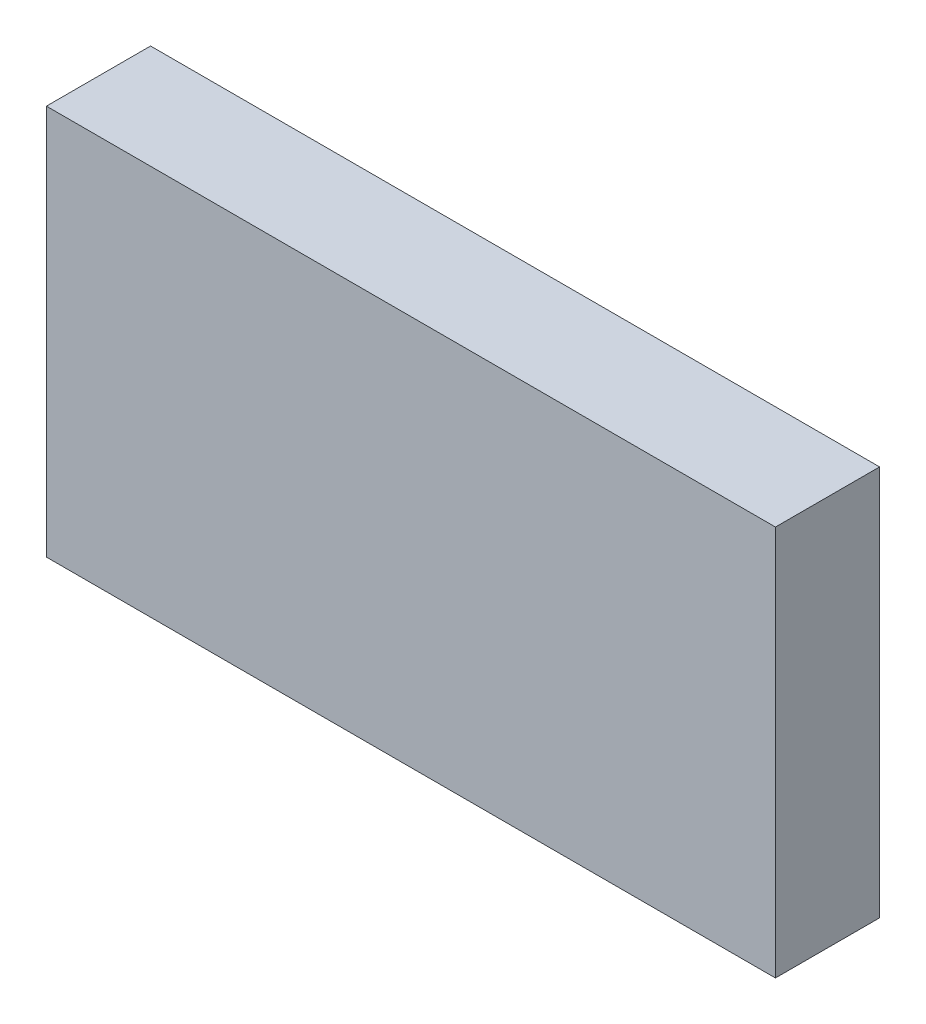
ISO-10303-21;
HEADER;
FILE_DESCRIPTION(('STEP AP214'),'2;1');
FILE_NAME('part.step','',(''),(''),'','','');
FILE_SCHEMA(('AUTOMOTIVE_DESIGN { 1 0 10303 214 1 1 1 1 }'));
ENDSEC;
DATA;
#1=APPLICATION_CONTEXT('core data for automotive mechanical design processes');
#2=APPLICATION_PROTOCOL_DEFINITION('international standard','automotive_design',2000,#1);
#3=PRODUCT_CONTEXT('',#1,'mechanical');
#4=PRODUCT('Part','Part','',(#3));
#5=PRODUCT_RELATED_PRODUCT_CATEGORY('part','',(#4));
#6=PRODUCT_DEFINITION_FORMATION('','',#4);
#7=PRODUCT_DEFINITION_CONTEXT('part definition',#1,'design');
#8=PRODUCT_DEFINITION('design','',#6,#7);
#9=PRODUCT_DEFINITION_SHAPE('','',#8);
#10=(LENGTH_UNIT() NAMED_UNIT(*) SI_UNIT(.MILLI.,.METRE.));
#11=(NAMED_UNIT(*) PLANE_ANGLE_UNIT() SI_UNIT($,.RADIAN.));
#12=(NAMED_UNIT(*) SI_UNIT($,.STERADIAN.) SOLID_ANGLE_UNIT());
#13=UNCERTAINTY_MEASURE_WITH_UNIT(LENGTH_MEASURE(1.E-05),#10,'distance_accuracy_value','');
#14=(GEOMETRIC_REPRESENTATION_CONTEXT(3) GLOBAL_UNCERTAINTY_ASSIGNED_CONTEXT((#13)) GLOBAL_UNIT_ASSIGNED_CONTEXT((#10,
#11,#12)) REPRESENTATION_CONTEXT('',''));
#15=CARTESIAN_POINT('',(0.,0.,0.));
#16=DIRECTION('',(0.,0.,1.));
#17=DIRECTION('',(1.,0.,0.));
#18=AXIS2_PLACEMENT_3D('',#15,#16,#17);
#19=CARTESIAN_POINT('',(0.78688616717888,-0.647007183565857,0.0826433070866142));
#20=DIRECTION('',(0.,0.,-1.));
#21=DIRECTION('',(0.,1.,0.));
#22=AXIS2_PLACEMENT_3D('',#19,#20,#21);
#23=PLANE('',#22);
#24=DIRECTION('',(0.,1.,0.));
#25=VECTOR('',#24,1.);
#26=CARTESIAN_POINT('',(0.790413726233998,-0.647007183565857,0.0826433070866142));
#27=LINE('',#26,#25);
#28=CARTESIAN_POINT('',(0.790413726233998,-0.607322144195778,0.0826433070866142));
#29=VERTEX_POINT('',#28);
#30=CARTESIAN_POINT('',(0.790413726233998,-0.64511741978633,0.0826433070866142));
#31=VERTEX_POINT('',#30);
#32=EDGE_CURVE('E71',#29,#31,#27,.F.);
#33=ORIENTED_EDGE('',*,*,#32,.T.);
#34=DIRECTION('',(1.,0.,0.));
#35=VECTOR('',#34,1.);
#36=CARTESIAN_POINT('',(0.864492466391478,-0.64511741978633,0.0826433070866142));
#37=LINE('',#36,#35);
#38=CARTESIAN_POINT('',(0.86096490733636,-0.64511741978633,0.0826433070866142));
#39=VERTEX_POINT('',#38);
#40=EDGE_CURVE('E54',#39,#31,#37,.F.);
#41=ORIENTED_EDGE('',*,*,#40,.F.);
#42=DIRECTION('',(0.,1.,0.));
#43=VECTOR('',#42,1.);
#44=CARTESIAN_POINT('',(0.86096490733636,-0.647007183565857,0.0826433070866142));
#45=LINE('',#44,#43);
#46=CARTESIAN_POINT('',(0.86096490733636,-0.607322144195778,0.0826433070866142));
#47=VERTEX_POINT('',#46);
#48=EDGE_CURVE('E20',#47,#39,#45,.F.);
#49=ORIENTED_EDGE('',*,*,#48,.F.);
#50=DIRECTION('',(1.,0.,0.));
#51=VECTOR('',#50,1.);
#52=CARTESIAN_POINT('',(0.864492466391478,-0.607322144195778,0.0826433070866142));
#53=LINE('',#52,#51);
#54=EDGE_CURVE('E81',#29,#47,#53,.T.);
#55=ORIENTED_EDGE('',*,*,#54,.F.);
#56=EDGE_LOOP('',(#33,#41,#49,#55));
#57=FACE_BOUND('',#56,.T.);
#58=ADVANCED_FACE('F17',(#57),#23,.F.);
#59=CARTESIAN_POINT('',(0.86096490733636,-0.647007183565857,0.0720606299212598));
#60=DIRECTION('',(-1.,0.,0.));
#61=DIRECTION('',(0.,0.,1.));
#62=AXIS2_PLACEMENT_3D('',#59,#60,#61);
#63=PLANE('',#62);
#64=DIRECTION('',(0.,0.,-1.));
#65=VECTOR('',#64,1.);
#66=CARTESIAN_POINT('',(0.86096490733636,-0.607322144195778,0.0831472440944882));
#67=LINE('',#66,#65);
#68=CARTESIAN_POINT('',(0.86096490733636,-0.607322144195778,0.0725645669291339));
#69=VERTEX_POINT('',#68);
#70=EDGE_CURVE('E64',#47,#69,#67,.T.);
#71=ORIENTED_EDGE('',*,*,#70,.F.);
#72=ORIENTED_EDGE('',*,*,#48,.T.);
#73=DIRECTION('',(0.,0.,1.));
#74=VECTOR('',#73,1.);
#75=CARTESIAN_POINT('',(0.86096490733636,-0.64511741978633,0.0720606299212598));
#76=LINE('',#75,#74);
#77=CARTESIAN_POINT('',(0.86096490733636,-0.64511741978633,0.0725645669291339));
#78=VERTEX_POINT('',#77);
#79=EDGE_CURVE('E62',#78,#39,#76,.T.);
#80=ORIENTED_EDGE('',*,*,#79,.F.);
#81=DIRECTION('',(0.,-1.,0.));
#82=VECTOR('',#81,1.);
#83=CARTESIAN_POINT('',(0.86096490733636,-0.647007183565857,0.0725645669291339));
#84=LINE('',#83,#82);
#85=EDGE_CURVE('E83',#69,#78,#84,.T.);
#86=ORIENTED_EDGE('',*,*,#85,.F.);
#87=EDGE_LOOP('',(#71,#72,#80,#86));
#88=FACE_BOUND('',#87,.T.);
#89=ADVANCED_FACE('F60',(#88),#63,.F.);
#90=CARTESIAN_POINT('',(0.864492466391478,-0.64511741978633,0.0720606299212598));
#91=DIRECTION('',(0.,1.,0.));
#92=DIRECTION('',(0.,0.,1.));
#93=AXIS2_PLACEMENT_3D('',#90,#91,#92);
#94=PLANE('',#93);
#95=DIRECTION('',(0.,0.,1.));
#96=VECTOR('',#95,1.);
#97=CARTESIAN_POINT('',(0.790413726233998,-0.64511741978633,0.0720606299212598));
#98=LINE('',#97,#96);
#99=CARTESIAN_POINT('',(0.790413726233998,-0.64511741978633,0.0725645669291339));
#100=VERTEX_POINT('',#99);
#101=EDGE_CURVE('E73',#31,#100,#98,.F.);
#102=ORIENTED_EDGE('',*,*,#101,.T.);
#103=DIRECTION('',(1.,0.,0.));
#104=VECTOR('',#103,1.);
#105=CARTESIAN_POINT('',(0.864492466391478,-0.64511741978633,0.0725645669291339));
#106=LINE('',#105,#104);
#107=EDGE_CURVE('E69',#78,#100,#106,.F.);
#108=ORIENTED_EDGE('',*,*,#107,.F.);
#109=ORIENTED_EDGE('',*,*,#79,.T.);
#110=ORIENTED_EDGE('',*,*,#40,.T.);
#111=EDGE_LOOP('',(#102,#108,#109,#110));
#112=FACE_BOUND('',#111,.T.);
#113=ADVANCED_FACE('F68',(#112),#94,.F.);
#114=CARTESIAN_POINT('',(0.790413726233998,-0.647007183565857,0.0720606299212598));
#115=DIRECTION('',(-1.,0.,0.));
#116=DIRECTION('',(0.,0.,1.));
#117=AXIS2_PLACEMENT_3D('',#114,#115,#116);
#118=PLANE('',#117);
#119=ORIENTED_EDGE('',*,*,#32,.F.);
#120=DIRECTION('',(0.,0.,-1.));
#121=VECTOR('',#120,1.);
#122=CARTESIAN_POINT('',(0.790413726233998,-0.607322144195778,0.0831472440944882));
#123=LINE('',#122,#121);
#124=CARTESIAN_POINT('',(0.790413726233998,-0.607322144195778,0.0725645669291339));
#125=VERTEX_POINT('',#124);
#126=EDGE_CURVE('E78',#125,#29,#123,.F.);
#127=ORIENTED_EDGE('',*,*,#126,.F.);
#128=DIRECTION('',(0.,-1.,0.));
#129=VECTOR('',#128,1.);
#130=CARTESIAN_POINT('',(0.790413726233998,-0.647007183565857,0.0725645669291339));
#131=LINE('',#130,#129);
#132=EDGE_CURVE('E26',#100,#125,#131,.F.);
#133=ORIENTED_EDGE('',*,*,#132,.F.);
#134=ORIENTED_EDGE('',*,*,#101,.F.);
#135=EDGE_LOOP('',(#119,#127,#133,#134));
#136=FACE_BOUND('',#135,.T.);
#137=ADVANCED_FACE('F88',(#136),#118,.T.);
#138=CARTESIAN_POINT('',(0.864492466391478,-0.607322144195778,0.0831472440944882));
#139=DIRECTION('',(0.,-1.,0.));
#140=DIRECTION('',(0.,0.,-1.));
#141=AXIS2_PLACEMENT_3D('',#138,#139,#140);
#142=PLANE('',#141);
#143=ORIENTED_EDGE('',*,*,#126,.T.);
#144=ORIENTED_EDGE('',*,*,#54,.T.);
#145=ORIENTED_EDGE('',*,*,#70,.T.);
#146=DIRECTION('',(1.,0.,0.));
#147=VECTOR('',#146,1.);
#148=CARTESIAN_POINT('',(0.864492466391478,-0.607322144195778,0.0725645669291339));
#149=LINE('',#148,#147);
#150=EDGE_CURVE('E11',#125,#69,#149,.T.);
#151=ORIENTED_EDGE('',*,*,#150,.F.);
#152=EDGE_LOOP('',(#143,#144,#145,#151));
#153=FACE_BOUND('',#152,.T.);
#154=ADVANCED_FACE('F91',(#153),#142,.F.);
#155=CARTESIAN_POINT('',(0.864492466391478,-0.647007183565857,0.0725645669291339));
#156=DIRECTION('',(0.,0.,1.));
#157=DIRECTION('',(0.,-1.,0.));
#158=AXIS2_PLACEMENT_3D('',#155,#156,#157);
#159=PLANE('',#158);
#160=ORIENTED_EDGE('',*,*,#132,.T.);
#161=ORIENTED_EDGE('',*,*,#150,.T.);
#162=ORIENTED_EDGE('',*,*,#85,.T.);
#163=ORIENTED_EDGE('',*,*,#107,.T.);
#164=EDGE_LOOP('',(#160,#161,#162,#163));
#165=FACE_BOUND('',#164,.T.);
#166=ADVANCED_FACE('F86',(#165),#159,.F.);
#167=CLOSED_SHELL('',(#58,#89,#113,#137,#154,#166));
#168=MANIFOLD_SOLID_BREP('B1',#167);
#169=ADVANCED_BREP_SHAPE_REPRESENTATION('',(#18,#168),#14);
#170=SHAPE_DEFINITION_REPRESENTATION(#9,#169);
ENDSEC;
END-ISO-10303-21;
